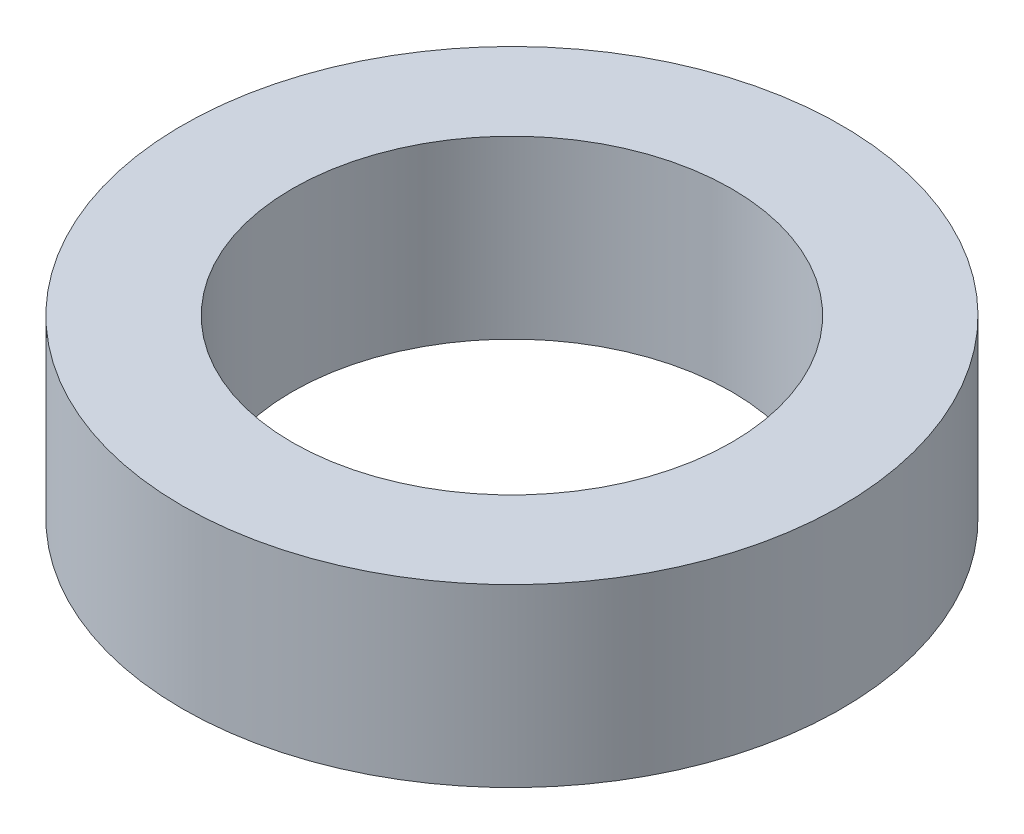
ISO-10303-21;
HEADER;
FILE_DESCRIPTION(('STEP AP214'),'2;1');
FILE_NAME('part.step','',(''),(''),'','','');
FILE_SCHEMA(('AUTOMOTIVE_DESIGN { 1 0 10303 214 1 1 1 1 }'));
ENDSEC;
DATA;
#1=APPLICATION_CONTEXT('core data for automotive mechanical design processes');
#2=APPLICATION_PROTOCOL_DEFINITION('international standard','automotive_design',2000,#1);
#3=PRODUCT_CONTEXT('',#1,'mechanical');
#4=PRODUCT('Part','Part','',(#3));
#5=PRODUCT_RELATED_PRODUCT_CATEGORY('part','',(#4));
#6=PRODUCT_DEFINITION_FORMATION('','',#4);
#7=PRODUCT_DEFINITION_CONTEXT('part definition',#1,'design');
#8=PRODUCT_DEFINITION('design','',#6,#7);
#9=PRODUCT_DEFINITION_SHAPE('','',#8);
#10=(LENGTH_UNIT() NAMED_UNIT(*) SI_UNIT(.MILLI.,.METRE.));
#11=(NAMED_UNIT(*) PLANE_ANGLE_UNIT() SI_UNIT($,.RADIAN.));
#12=(NAMED_UNIT(*) SI_UNIT($,.STERADIAN.) SOLID_ANGLE_UNIT());
#13=UNCERTAINTY_MEASURE_WITH_UNIT(LENGTH_MEASURE(1.E-05),#10,'distance_accuracy_value','');
#14=(GEOMETRIC_REPRESENTATION_CONTEXT(3) GLOBAL_UNCERTAINTY_ASSIGNED_CONTEXT((#13)) GLOBAL_UNIT_ASSIGNED_CONTEXT((#10,
#11,#12)) REPRESENTATION_CONTEXT('',''));
#15=CARTESIAN_POINT('',(0.,0.,0.));
#16=DIRECTION('',(0.,0.,1.));
#17=DIRECTION('',(1.,0.,0.));
#18=AXIS2_PLACEMENT_3D('',#15,#16,#17);
#19=CARTESIAN_POINT('',(0.,4.,0.));
#20=DIRECTION('',(0.,1.,0.));
#21=DIRECTION('',(0.,0.,1.));
#22=AXIS2_PLACEMENT_3D('',#19,#20,#21);
#23=PLANE('',#22);
#24=CARTESIAN_POINT('',(0.,4.,0.));
#25=DIRECTION('',(0.,1.,0.));
#26=DIRECTION('',(0.,0.,1.));
#27=AXIS2_PLACEMENT_3D('',#24,#25,#26);
#28=CIRCLE('',#27,7.5);
#29=CARTESIAN_POINT('',(0.,4.,7.5));
#30=VERTEX_POINT('',#29);
#31=EDGE_CURVE('E10',#30,#30,#28,.T.);
#32=ORIENTED_EDGE('',*,*,#31,.T.);
#33=EDGE_LOOP('',(#32));
#34=FACE_BOUND('',#33,.T.);
#35=CARTESIAN_POINT('',(0.,4.,0.));
#36=DIRECTION('',(0.,1.,0.));
#37=DIRECTION('',(0.,0.,1.));
#38=AXIS2_PLACEMENT_3D('',#35,#36,#37);
#39=CIRCLE('',#38,5.);
#40=CARTESIAN_POINT('',(0.,4.,5.));
#41=VERTEX_POINT('',#40);
#42=EDGE_CURVE('E48',#41,#41,#39,.T.);
#43=ORIENTED_EDGE('',*,*,#42,.F.);
#44=EDGE_LOOP('',(#43));
#45=FACE_BOUND('',#44,.T.);
#46=ADVANCED_FACE('F37',(#34,#45),#23,.T.);
#47=CARTESIAN_POINT('',(0.,0.,0.));
#48=DIRECTION('',(0.,1.,0.));
#49=DIRECTION('',(0.,0.,1.));
#50=AXIS2_PLACEMENT_3D('',#47,#48,#49);
#51=PLANE('',#50);
#52=CARTESIAN_POINT('',(0.,0.,0.));
#53=DIRECTION('',(0.,1.,0.));
#54=DIRECTION('',(0.,0.,1.));
#55=AXIS2_PLACEMENT_3D('',#52,#53,#54);
#56=CIRCLE('',#55,7.5);
#57=CARTESIAN_POINT('',(0.,0.,7.5));
#58=VERTEX_POINT('',#57);
#59=EDGE_CURVE('E41',#58,#58,#56,.T.);
#60=ORIENTED_EDGE('',*,*,#59,.F.);
#61=EDGE_LOOP('',(#60));
#62=FACE_BOUND('',#61,.T.);
#63=CARTESIAN_POINT('',(0.,0.,0.));
#64=DIRECTION('',(0.,1.,0.));
#65=DIRECTION('',(0.,0.,1.));
#66=AXIS2_PLACEMENT_3D('',#63,#64,#65);
#67=CIRCLE('',#66,5.);
#68=CARTESIAN_POINT('',(0.,0.,5.));
#69=VERTEX_POINT('',#68);
#70=EDGE_CURVE('E50',#69,#69,#67,.T.);
#71=ORIENTED_EDGE('',*,*,#70,.T.);
#72=EDGE_LOOP('',(#71));
#73=FACE_BOUND('',#72,.T.);
#74=ADVANCED_FACE('F60',(#62,#73),#51,.F.);
#75=CARTESIAN_POINT('',(0.,4.,0.));
#76=DIRECTION('',(0.,-1.,0.));
#77=DIRECTION('',(0.,0.,-1.));
#78=AXIS2_PLACEMENT_3D('',#75,#76,#77);
#79=CYLINDRICAL_SURFACE('',#78,7.5);
#80=ORIENTED_EDGE('',*,*,#31,.F.);
#81=EDGE_LOOP('',(#80));
#82=FACE_BOUND('',#81,.T.);
#83=ORIENTED_EDGE('',*,*,#59,.T.);
#84=EDGE_LOOP('',(#83));
#85=FACE_BOUND('',#84,.T.);
#86=ADVANCED_FACE('F39',(#82,#85),#79,.T.);
#87=CARTESIAN_POINT('',(0.,4.,0.));
#88=DIRECTION('',(0.,-1.,0.));
#89=DIRECTION('',(0.,0.,-1.));
#90=AXIS2_PLACEMENT_3D('',#87,#88,#89);
#91=CYLINDRICAL_SURFACE('',#90,5.);
#92=ORIENTED_EDGE('',*,*,#42,.T.);
#93=EDGE_LOOP('',(#92));
#94=FACE_BOUND('',#93,.T.);
#95=ORIENTED_EDGE('',*,*,#70,.F.);
#96=EDGE_LOOP('',(#95));
#97=FACE_BOUND('',#96,.T.);
#98=ADVANCED_FACE('F56',(#94,#97),#91,.F.);
#99=CLOSED_SHELL('',(#46,#74,#86,#98));
#100=MANIFOLD_SOLID_BREP('B2',#99);
#101=ADVANCED_BREP_SHAPE_REPRESENTATION('',(#18,#100),#14);
#102=SHAPE_DEFINITION_REPRESENTATION(#9,#101);
ENDSEC;
END-ISO-10303-21;
